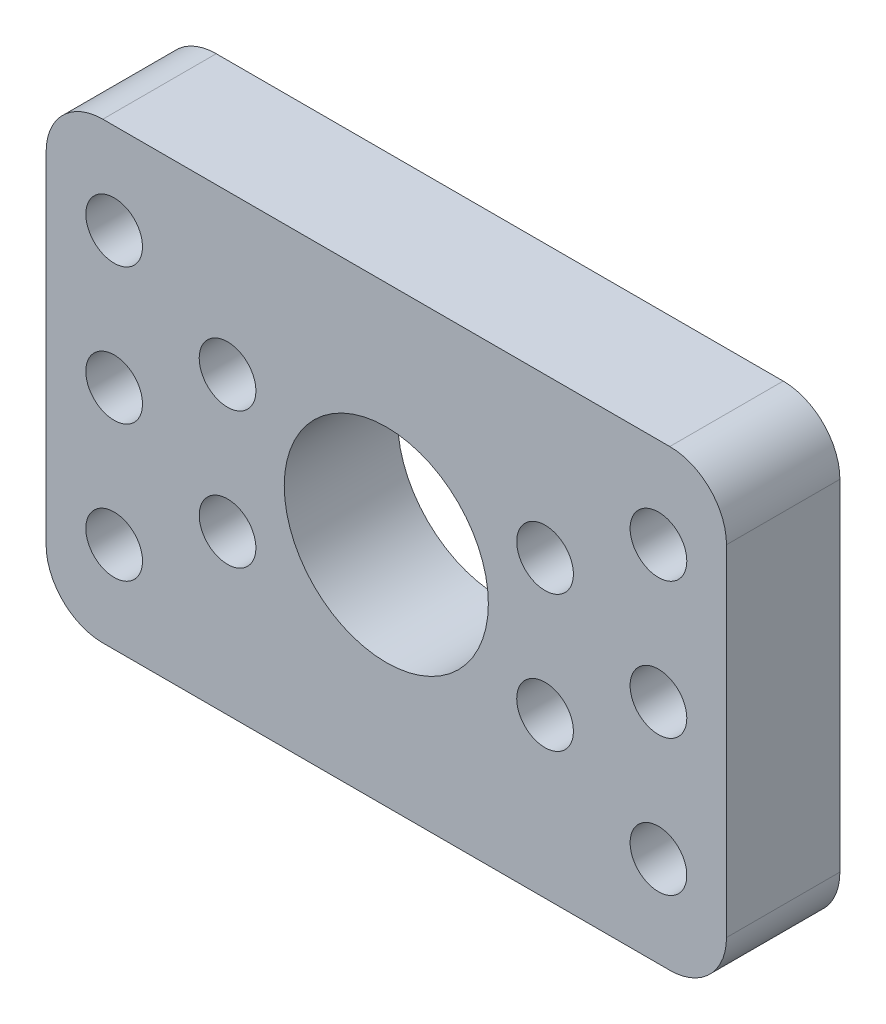
ISO-10303-21;
HEADER;
FILE_DESCRIPTION(('STEP AP214'),'2;1');
FILE_NAME('part.step','',(''),(''),'','','');
FILE_SCHEMA(('AUTOMOTIVE_DESIGN { 1 0 10303 214 1 1 1 1 }'));
ENDSEC;
DATA;
#1=APPLICATION_CONTEXT('core data for automotive mechanical design processes');
#2=APPLICATION_PROTOCOL_DEFINITION('international standard','automotive_design',2000,#1);
#3=PRODUCT_CONTEXT('',#1,'mechanical');
#4=PRODUCT('Part','Part','',(#3));
#5=PRODUCT_RELATED_PRODUCT_CATEGORY('part','',(#4));
#6=PRODUCT_DEFINITION_FORMATION('','',#4);
#7=PRODUCT_DEFINITION_CONTEXT('part definition',#1,'design');
#8=PRODUCT_DEFINITION('design','',#6,#7);
#9=PRODUCT_DEFINITION_SHAPE('','',#8);
#10=(LENGTH_UNIT() NAMED_UNIT(*) SI_UNIT(.MILLI.,.METRE.));
#11=(NAMED_UNIT(*) PLANE_ANGLE_UNIT() SI_UNIT($,.RADIAN.));
#12=(NAMED_UNIT(*) SI_UNIT($,.STERADIAN.) SOLID_ANGLE_UNIT());
#13=UNCERTAINTY_MEASURE_WITH_UNIT(LENGTH_MEASURE(1.E-05),#10,'distance_accuracy_value','');
#14=(GEOMETRIC_REPRESENTATION_CONTEXT(3) GLOBAL_UNCERTAINTY_ASSIGNED_CONTEXT((#13)) GLOBAL_UNIT_ASSIGNED_CONTEXT((#10,
#11,#12)) REPRESENTATION_CONTEXT('',''));
#15=CARTESIAN_POINT('',(0.,0.,0.));
#16=DIRECTION('',(0.,0.,1.));
#17=DIRECTION('',(1.,0.,0.));
#18=AXIS2_PLACEMENT_3D('',#15,#16,#17);
#19=CARTESIAN_POINT('',(25.,15.,10.));
#20=DIRECTION('',(0.,0.,-1.));
#21=DIRECTION('',(-1.,0.,0.));
#22=AXIS2_PLACEMENT_3D('',#19,#20,#21);
#23=PLANE('',#22);
#24=CARTESIAN_POINT('',(-14.,-6.,10.));
#25=DIRECTION('',(0.,0.,-1.));
#26=DIRECTION('',(1.,0.,0.));
#27=AXIS2_PLACEMENT_3D('',#24,#25,#26);
#28=CIRCLE('',#27,2.5);
#29=CARTESIAN_POINT('',(-11.5,-6.,10.));
#30=VERTEX_POINT('',#29);
#31=EDGE_CURVE('E221',#30,#30,#28,.T.);
#32=ORIENTED_EDGE('',*,*,#31,.T.);
#33=EDGE_LOOP('',(#32));
#34=FACE_BOUND('',#33,.T.);
#35=CARTESIAN_POINT('',(-24.,-12.,10.));
#36=DIRECTION('',(0.,0.,-1.));
#37=DIRECTION('',(1.,0.,0.));
#38=AXIS2_PLACEMENT_3D('',#35,#36,#37);
#39=CIRCLE('',#38,2.5);
#40=CARTESIAN_POINT('',(-21.5,-12.,10.));
#41=VERTEX_POINT('',#40);
#42=EDGE_CURVE('E227',#41,#41,#39,.T.);
#43=ORIENTED_EDGE('',*,*,#42,.T.);
#44=EDGE_LOOP('',(#43));
#45=FACE_BOUND('',#44,.T.);
#46=CARTESIAN_POINT('',(-24.,12.,10.));
#47=DIRECTION('',(0.,0.,-1.));
#48=DIRECTION('',(-1.,0.,0.));
#49=AXIS2_PLACEMENT_3D('',#46,#47,#48);
#50=CIRCLE('',#49,2.5);
#51=CARTESIAN_POINT('',(-26.5,12.,10.));
#52=VERTEX_POINT('',#51);
#53=EDGE_CURVE('E233',#52,#52,#50,.T.);
#54=ORIENTED_EDGE('',*,*,#53,.T.);
#55=EDGE_LOOP('',(#54));
#56=FACE_BOUND('',#55,.T.);
#57=CARTESIAN_POINT('',(-24.,0.,10.));
#58=DIRECTION('',(0.,0.,-1.));
#59=DIRECTION('',(-1.,0.,0.));
#60=AXIS2_PLACEMENT_3D('',#57,#58,#59);
#61=CIRCLE('',#60,2.5);
#62=CARTESIAN_POINT('',(-26.5,0.,10.));
#63=VERTEX_POINT('',#62);
#64=EDGE_CURVE('E239',#63,#63,#61,.T.);
#65=ORIENTED_EDGE('',*,*,#64,.T.);
#66=EDGE_LOOP('',(#65));
#67=FACE_BOUND('',#66,.T.);
#68=CARTESIAN_POINT('',(-14.,6.,10.));
#69=DIRECTION('',(0.,0.,-1.));
#70=DIRECTION('',(-1.,0.,0.));
#71=AXIS2_PLACEMENT_3D('',#68,#69,#70);
#72=CIRCLE('',#71,2.5);
#73=CARTESIAN_POINT('',(-16.5,6.,10.));
#74=VERTEX_POINT('',#73);
#75=EDGE_CURVE('E215',#74,#74,#72,.T.);
#76=ORIENTED_EDGE('',*,*,#75,.T.);
#77=EDGE_LOOP('',(#76));
#78=FACE_BOUND('',#77,.T.);
#79=CARTESIAN_POINT('',(14.,-6.,10.));
#80=DIRECTION('',(0.,0.,1.));
#81=DIRECTION('',(-1.,0.,0.));
#82=AXIS2_PLACEMENT_3D('',#79,#80,#81);
#83=CIRCLE('',#82,2.5);
#84=CARTESIAN_POINT('',(11.5,-6.,10.));
#85=VERTEX_POINT('',#84);
#86=EDGE_CURVE('E191',#85,#85,#83,.T.);
#87=ORIENTED_EDGE('',*,*,#86,.F.);
#88=EDGE_LOOP('',(#87));
#89=FACE_BOUND('',#88,.T.);
#90=CARTESIAN_POINT('',(24.,-12.,10.));
#91=DIRECTION('',(0.,0.,1.));
#92=DIRECTION('',(-1.,0.,0.));
#93=AXIS2_PLACEMENT_3D('',#90,#91,#92);
#94=CIRCLE('',#93,2.5);
#95=CARTESIAN_POINT('',(21.5,-12.,10.));
#96=VERTEX_POINT('',#95);
#97=EDGE_CURVE('E198',#96,#96,#94,.T.);
#98=ORIENTED_EDGE('',*,*,#97,.F.);
#99=EDGE_LOOP('',(#98));
#100=FACE_BOUND('',#99,.T.);
#101=CARTESIAN_POINT('',(24.,12.,10.));
#102=DIRECTION('',(0.,0.,1.));
#103=DIRECTION('',(1.,0.,0.));
#104=AXIS2_PLACEMENT_3D('',#101,#102,#103);
#105=CIRCLE('',#104,2.5);
#106=CARTESIAN_POINT('',(26.5,12.,10.));
#107=VERTEX_POINT('',#106);
#108=EDGE_CURVE('E204',#107,#107,#105,.T.);
#109=ORIENTED_EDGE('',*,*,#108,.F.);
#110=EDGE_LOOP('',(#109));
#111=FACE_BOUND('',#110,.T.);
#112=CARTESIAN_POINT('',(24.,0.,10.));
#113=DIRECTION('',(0.,0.,1.));
#114=DIRECTION('',(1.,0.,0.));
#115=AXIS2_PLACEMENT_3D('',#112,#113,#114);
#116=CIRCLE('',#115,2.5);
#117=CARTESIAN_POINT('',(26.5,0.,10.));
#118=VERTEX_POINT('',#117);
#119=EDGE_CURVE('E210',#118,#118,#116,.T.);
#120=ORIENTED_EDGE('',*,*,#119,.F.);
#121=EDGE_LOOP('',(#120));
#122=FACE_BOUND('',#121,.T.);
#123=CARTESIAN_POINT('',(14.,6.,10.));
#124=DIRECTION('',(0.,0.,1.));
#125=DIRECTION('',(1.,0.,0.));
#126=AXIS2_PLACEMENT_3D('',#123,#124,#125);
#127=CIRCLE('',#126,2.5);
#128=CARTESIAN_POINT('',(16.5,6.,10.));
#129=VERTEX_POINT('',#128);
#130=EDGE_CURVE('E185',#129,#129,#127,.T.);
#131=ORIENTED_EDGE('',*,*,#130,.F.);
#132=EDGE_LOOP('',(#131));
#133=FACE_BOUND('',#132,.T.);
#134=CARTESIAN_POINT('',(25.,15.,10.));
#135=DIRECTION('',(0.,0.,1.));
#136=DIRECTION('',(-1.,0.,0.));
#137=AXIS2_PLACEMENT_3D('',#134,#135,#136);
#138=CIRCLE('',#137,5.);
#139=CARTESIAN_POINT('',(30.,15.,10.));
#140=VERTEX_POINT('',#139);
#141=CARTESIAN_POINT('',(25.,20.,10.));
#142=VERTEX_POINT('',#141);
#143=EDGE_CURVE('E145',#140,#142,#138,.T.);
#144=ORIENTED_EDGE('',*,*,#143,.T.);
#145=DIRECTION('',(-1.,0.,0.));
#146=VECTOR('',#145,1.);
#147=CARTESIAN_POINT('',(-25.,20.,10.));
#148=LINE('',#147,#146);
#149=CARTESIAN_POINT('',(-25.,20.,10.));
#150=VERTEX_POINT('',#149);
#151=EDGE_CURVE('E93',#142,#150,#148,.T.);
#152=ORIENTED_EDGE('',*,*,#151,.T.);
#153=CARTESIAN_POINT('',(-25.,15.,10.));
#154=DIRECTION('',(0.,0.,1.));
#155=DIRECTION('',(1.,0.,0.));
#156=AXIS2_PLACEMENT_3D('',#153,#154,#155);
#157=CIRCLE('',#156,5.);
#158=CARTESIAN_POINT('',(-30.,15.,10.));
#159=VERTEX_POINT('',#158);
#160=EDGE_CURVE('E160',#150,#159,#157,.T.);
#161=ORIENTED_EDGE('',*,*,#160,.T.);
#162=DIRECTION('',(0.,-1.,0.));
#163=VECTOR('',#162,1.);
#164=CARTESIAN_POINT('',(-30.,15.,10.));
#165=LINE('',#164,#163);
#166=CARTESIAN_POINT('',(-30.,-15.,10.));
#167=VERTEX_POINT('',#166);
#168=EDGE_CURVE('E173',#159,#167,#165,.T.);
#169=ORIENTED_EDGE('',*,*,#168,.T.);
#170=CARTESIAN_POINT('',(-25.,-15.,10.));
#171=DIRECTION('',(0.,0.,1.));
#172=DIRECTION('',(1.,0.,0.));
#173=AXIS2_PLACEMENT_3D('',#170,#171,#172);
#174=CIRCLE('',#173,5.);
#175=CARTESIAN_POINT('',(-25.,-20.,10.));
#176=VERTEX_POINT('',#175);
#177=EDGE_CURVE('E112',#167,#176,#174,.T.);
#178=ORIENTED_EDGE('',*,*,#177,.T.);
#179=DIRECTION('',(1.,0.,0.));
#180=VECTOR('',#179,1.);
#181=CARTESIAN_POINT('',(-25.,-20.,10.));
#182=LINE('',#181,#180);
#183=CARTESIAN_POINT('',(25.,-20.,10.));
#184=VERTEX_POINT('',#183);
#185=EDGE_CURVE('E106',#176,#184,#182,.T.);
#186=ORIENTED_EDGE('',*,*,#185,.T.);
#187=CARTESIAN_POINT('',(25.,-15.,10.));
#188=DIRECTION('',(0.,0.,1.));
#189=DIRECTION('',(1.,0.,0.));
#190=AXIS2_PLACEMENT_3D('',#187,#188,#189);
#191=CIRCLE('',#190,5.);
#192=CARTESIAN_POINT('',(30.,-15.,10.));
#193=VERTEX_POINT('',#192);
#194=EDGE_CURVE('E110',#184,#193,#191,.T.);
#195=ORIENTED_EDGE('',*,*,#194,.T.);
#196=DIRECTION('',(0.,1.,0.));
#197=VECTOR('',#196,1.);
#198=CARTESIAN_POINT('',(30.,15.,10.));
#199=LINE('',#198,#197);
#200=EDGE_CURVE('E50',#193,#140,#199,.T.);
#201=ORIENTED_EDGE('',*,*,#200,.T.);
#202=EDGE_LOOP('',(#144,#152,#161,#169,#178,#186,#195,#201));
#203=FACE_BOUND('',#202,.T.);
#204=CARTESIAN_POINT('',(0.,0.,10.));
#205=DIRECTION('',(0.,0.,1.));
#206=DIRECTION('',(1.,0.,0.));
#207=AXIS2_PLACEMENT_3D('',#204,#205,#206);
#208=CIRCLE('',#207,9.);
#209=CARTESIAN_POINT('',(9.,0.,10.));
#210=VERTEX_POINT('',#209);
#211=EDGE_CURVE('E134',#210,#210,#208,.T.);
#212=ORIENTED_EDGE('',*,*,#211,.F.);
#213=EDGE_LOOP('',(#212));
#214=FACE_BOUND('',#213,.T.);
#215=ADVANCED_FACE('F33',(#34,#45,#56,#67,#78,#89,#100,#111,#122,#133,#203,#214),#23,.F.);
#216=CARTESIAN_POINT('',(25.,15.,0.));
#217=DIRECTION('',(0.,0.,-1.));
#218=DIRECTION('',(-1.,0.,0.));
#219=AXIS2_PLACEMENT_3D('',#216,#217,#218);
#220=PLANE('',#219);
#221=CARTESIAN_POINT('',(-14.,-6.,0.));
#222=DIRECTION('',(0.,0.,-1.));
#223=DIRECTION('',(1.,0.,0.));
#224=AXIS2_PLACEMENT_3D('',#221,#222,#223);
#225=CIRCLE('',#224,2.5);
#226=CARTESIAN_POINT('',(-11.5,-6.,0.));
#227=VERTEX_POINT('',#226);
#228=EDGE_CURVE('E224',#227,#227,#225,.T.);
#229=ORIENTED_EDGE('',*,*,#228,.F.);
#230=EDGE_LOOP('',(#229));
#231=FACE_BOUND('',#230,.T.);
#232=CARTESIAN_POINT('',(-24.,-12.,0.));
#233=DIRECTION('',(0.,0.,-1.));
#234=DIRECTION('',(1.,0.,0.));
#235=AXIS2_PLACEMENT_3D('',#232,#233,#234);
#236=CIRCLE('',#235,2.5);
#237=CARTESIAN_POINT('',(-21.5,-12.,0.));
#238=VERTEX_POINT('',#237);
#239=EDGE_CURVE('E230',#238,#238,#236,.T.);
#240=ORIENTED_EDGE('',*,*,#239,.F.);
#241=EDGE_LOOP('',(#240));
#242=FACE_BOUND('',#241,.T.);
#243=CARTESIAN_POINT('',(-24.,12.,0.));
#244=DIRECTION('',(0.,0.,-1.));
#245=DIRECTION('',(-1.,0.,0.));
#246=AXIS2_PLACEMENT_3D('',#243,#244,#245);
#247=CIRCLE('',#246,2.5);
#248=CARTESIAN_POINT('',(-26.5,12.,0.));
#249=VERTEX_POINT('',#248);
#250=EDGE_CURVE('E236',#249,#249,#247,.T.);
#251=ORIENTED_EDGE('',*,*,#250,.F.);
#252=EDGE_LOOP('',(#251));
#253=FACE_BOUND('',#252,.T.);
#254=CARTESIAN_POINT('',(-24.,0.,0.));
#255=DIRECTION('',(0.,0.,-1.));
#256=DIRECTION('',(-1.,0.,0.));
#257=AXIS2_PLACEMENT_3D('',#254,#255,#256);
#258=CIRCLE('',#257,2.5);
#259=CARTESIAN_POINT('',(-26.5,0.,0.));
#260=VERTEX_POINT('',#259);
#261=EDGE_CURVE('E218',#260,#260,#258,.T.);
#262=ORIENTED_EDGE('',*,*,#261,.F.);
#263=EDGE_LOOP('',(#262));
#264=FACE_BOUND('',#263,.T.);
#265=CARTESIAN_POINT('',(-14.,6.,0.));
#266=DIRECTION('',(0.,0.,-1.));
#267=DIRECTION('',(-1.,0.,0.));
#268=AXIS2_PLACEMENT_3D('',#265,#266,#267);
#269=CIRCLE('',#268,2.5);
#270=CARTESIAN_POINT('',(-16.5,6.,0.));
#271=VERTEX_POINT('',#270);
#272=EDGE_CURVE('E195',#271,#271,#269,.T.);
#273=ORIENTED_EDGE('',*,*,#272,.F.);
#274=EDGE_LOOP('',(#273));
#275=FACE_BOUND('',#274,.T.);
#276=CARTESIAN_POINT('',(14.,-6.,0.));
#277=DIRECTION('',(0.,0.,1.));
#278=DIRECTION('',(-1.,0.,0.));
#279=AXIS2_PLACEMENT_3D('',#276,#277,#278);
#280=CIRCLE('',#279,2.5);
#281=CARTESIAN_POINT('',(11.5,-6.,0.));
#282=VERTEX_POINT('',#281);
#283=EDGE_CURVE('E194',#282,#282,#280,.T.);
#284=ORIENTED_EDGE('',*,*,#283,.T.);
#285=EDGE_LOOP('',(#284));
#286=FACE_BOUND('',#285,.T.);
#287=CARTESIAN_POINT('',(24.,-12.,0.));
#288=DIRECTION('',(0.,0.,1.));
#289=DIRECTION('',(-1.,0.,0.));
#290=AXIS2_PLACEMENT_3D('',#287,#288,#289);
#291=CIRCLE('',#290,2.5);
#292=CARTESIAN_POINT('',(21.5,-12.,0.));
#293=VERTEX_POINT('',#292);
#294=EDGE_CURVE('E201',#293,#293,#291,.T.);
#295=ORIENTED_EDGE('',*,*,#294,.T.);
#296=EDGE_LOOP('',(#295));
#297=FACE_BOUND('',#296,.T.);
#298=CARTESIAN_POINT('',(24.,12.,0.));
#299=DIRECTION('',(0.,0.,1.));
#300=DIRECTION('',(1.,0.,0.));
#301=AXIS2_PLACEMENT_3D('',#298,#299,#300);
#302=CIRCLE('',#301,2.5);
#303=CARTESIAN_POINT('',(26.5,12.,0.));
#304=VERTEX_POINT('',#303);
#305=EDGE_CURVE('E207',#304,#304,#302,.T.);
#306=ORIENTED_EDGE('',*,*,#305,.T.);
#307=EDGE_LOOP('',(#306));
#308=FACE_BOUND('',#307,.T.);
#309=CARTESIAN_POINT('',(24.,0.,0.));
#310=DIRECTION('',(0.,0.,1.));
#311=DIRECTION('',(1.,0.,0.));
#312=AXIS2_PLACEMENT_3D('',#309,#310,#311);
#313=CIRCLE('',#312,2.5);
#314=CARTESIAN_POINT('',(26.5,0.,0.));
#315=VERTEX_POINT('',#314);
#316=EDGE_CURVE('E188',#315,#315,#313,.T.);
#317=ORIENTED_EDGE('',*,*,#316,.T.);
#318=EDGE_LOOP('',(#317));
#319=FACE_BOUND('',#318,.T.);
#320=CARTESIAN_POINT('',(14.,6.,0.));
#321=DIRECTION('',(0.,0.,1.));
#322=DIRECTION('',(1.,0.,0.));
#323=AXIS2_PLACEMENT_3D('',#320,#321,#322);
#324=CIRCLE('',#323,2.5);
#325=CARTESIAN_POINT('',(16.5,6.,0.));
#326=VERTEX_POINT('',#325);
#327=EDGE_CURVE('E182',#326,#326,#324,.T.);
#328=ORIENTED_EDGE('',*,*,#327,.T.);
#329=EDGE_LOOP('',(#328));
#330=FACE_BOUND('',#329,.T.);
#331=CARTESIAN_POINT('',(25.,15.,0.));
#332=DIRECTION('',(0.,0.,1.));
#333=DIRECTION('',(-1.,0.,0.));
#334=AXIS2_PLACEMENT_3D('',#331,#332,#333);
#335=CIRCLE('',#334,5.);
#336=CARTESIAN_POINT('',(30.,15.,0.));
#337=VERTEX_POINT('',#336);
#338=CARTESIAN_POINT('',(25.,20.,0.));
#339=VERTEX_POINT('',#338);
#340=EDGE_CURVE('E130',#337,#339,#335,.T.);
#341=ORIENTED_EDGE('',*,*,#340,.F.);
#342=DIRECTION('',(0.,1.,0.));
#343=VECTOR('',#342,1.);
#344=CARTESIAN_POINT('',(30.,15.,0.));
#345=LINE('',#344,#343);
#346=CARTESIAN_POINT('',(30.,-15.,0.));
#347=VERTEX_POINT('',#346);
#348=EDGE_CURVE('E85',#347,#337,#345,.T.);
#349=ORIENTED_EDGE('',*,*,#348,.F.);
#350=CARTESIAN_POINT('',(25.,-15.,0.));
#351=DIRECTION('',(0.,0.,1.));
#352=DIRECTION('',(1.,0.,0.));
#353=AXIS2_PLACEMENT_3D('',#350,#351,#352);
#354=CIRCLE('',#353,5.);
#355=CARTESIAN_POINT('',(25.,-20.,0.));
#356=VERTEX_POINT('',#355);
#357=EDGE_CURVE('E79',#356,#347,#354,.T.);
#358=ORIENTED_EDGE('',*,*,#357,.F.);
#359=DIRECTION('',(1.,0.,0.));
#360=VECTOR('',#359,1.);
#361=CARTESIAN_POINT('',(-25.,-20.,0.));
#362=LINE('',#361,#360);
#363=CARTESIAN_POINT('',(-25.,-20.,0.));
#364=VERTEX_POINT('',#363);
#365=EDGE_CURVE('E120',#364,#356,#362,.T.);
#366=ORIENTED_EDGE('',*,*,#365,.F.);
#367=CARTESIAN_POINT('',(-25.,-15.,0.));
#368=DIRECTION('',(0.,0.,1.));
#369=DIRECTION('',(1.,0.,0.));
#370=AXIS2_PLACEMENT_3D('',#367,#368,#369);
#371=CIRCLE('',#370,5.);
#372=CARTESIAN_POINT('',(-30.,-15.,0.));
#373=VERTEX_POINT('',#372);
#374=EDGE_CURVE('E140',#373,#364,#371,.T.);
#375=ORIENTED_EDGE('',*,*,#374,.F.);
#376=DIRECTION('',(0.,-1.,0.));
#377=VECTOR('',#376,1.);
#378=CARTESIAN_POINT('',(-30.,15.,0.));
#379=LINE('',#378,#377);
#380=CARTESIAN_POINT('',(-30.,15.,0.));
#381=VERTEX_POINT('',#380);
#382=EDGE_CURVE('E138',#381,#373,#379,.T.);
#383=ORIENTED_EDGE('',*,*,#382,.F.);
#384=CARTESIAN_POINT('',(-25.,15.,0.));
#385=DIRECTION('',(0.,0.,1.));
#386=DIRECTION('',(1.,0.,0.));
#387=AXIS2_PLACEMENT_3D('',#384,#385,#386);
#388=CIRCLE('',#387,5.);
#389=CARTESIAN_POINT('',(-25.,20.,0.));
#390=VERTEX_POINT('',#389);
#391=EDGE_CURVE('E136',#390,#381,#388,.T.);
#392=ORIENTED_EDGE('',*,*,#391,.F.);
#393=DIRECTION('',(-1.,0.,0.));
#394=VECTOR('',#393,1.);
#395=CARTESIAN_POINT('',(-25.,20.,0.));
#396=LINE('',#395,#394);
#397=EDGE_CURVE('E133',#339,#390,#396,.T.);
#398=ORIENTED_EDGE('',*,*,#397,.F.);
#399=EDGE_LOOP('',(#341,#349,#358,#366,#375,#383,#392,#398));
#400=FACE_BOUND('',#399,.T.);
#401=CARTESIAN_POINT('',(0.,0.,0.));
#402=DIRECTION('',(0.,0.,1.));
#403=DIRECTION('',(1.,0.,0.));
#404=AXIS2_PLACEMENT_3D('',#401,#402,#403);
#405=CIRCLE('',#404,9.);
#406=CARTESIAN_POINT('',(9.,0.,0.));
#407=VERTEX_POINT('',#406);
#408=EDGE_CURVE('E179',#407,#407,#405,.T.);
#409=ORIENTED_EDGE('',*,*,#408,.T.);
#410=EDGE_LOOP('',(#409));
#411=FACE_BOUND('',#410,.T.);
#412=ADVANCED_FACE('F164',(#231,#242,#253,#264,#275,#286,#297,#308,#319,#330,#400,#411),#220,.T.);
#413=CARTESIAN_POINT('',(25.,15.,10.));
#414=DIRECTION('',(0.,0.,-1.));
#415=DIRECTION('',(-1.,0.,0.));
#416=AXIS2_PLACEMENT_3D('',#413,#414,#415);
#417=CYLINDRICAL_SURFACE('',#416,5.);
#418=ORIENTED_EDGE('',*,*,#340,.T.);
#419=DIRECTION('',(0.,0.,-1.));
#420=VECTOR('',#419,1.);
#421=CARTESIAN_POINT('',(25.,20.,10.));
#422=LINE('',#421,#420);
#423=EDGE_CURVE('E11',#142,#339,#422,.T.);
#424=ORIENTED_EDGE('',*,*,#423,.F.);
#425=ORIENTED_EDGE('',*,*,#143,.F.);
#426=DIRECTION('',(0.,0.,-1.));
#427=VECTOR('',#426,1.);
#428=CARTESIAN_POINT('',(30.,15.,10.));
#429=LINE('',#428,#427);
#430=EDGE_CURVE('E126',#140,#337,#429,.T.);
#431=ORIENTED_EDGE('',*,*,#430,.T.);
#432=EDGE_LOOP('',(#418,#424,#425,#431));
#433=FACE_BOUND('',#432,.T.);
#434=ADVANCED_FACE('F35',(#433),#417,.T.);
#435=CARTESIAN_POINT('',(-25.,20.,10.));
#436=DIRECTION('',(0.,-1.,0.));
#437=DIRECTION('',(0.,0.,-1.));
#438=AXIS2_PLACEMENT_3D('',#435,#436,#437);
#439=PLANE('',#438);
#440=ORIENTED_EDGE('',*,*,#397,.T.);
#441=DIRECTION('',(0.,0.,-1.));
#442=VECTOR('',#441,1.);
#443=CARTESIAN_POINT('',(-25.,20.,10.));
#444=LINE('',#443,#442);
#445=EDGE_CURVE('E42',#150,#390,#444,.T.);
#446=ORIENTED_EDGE('',*,*,#445,.F.);
#447=ORIENTED_EDGE('',*,*,#151,.F.);
#448=ORIENTED_EDGE('',*,*,#423,.T.);
#449=EDGE_LOOP('',(#440,#446,#447,#448));
#450=FACE_BOUND('',#449,.T.);
#451=ADVANCED_FACE('F292',(#450),#439,.F.);
#452=CARTESIAN_POINT('',(-25.,15.,10.));
#453=DIRECTION('',(0.,0.,-1.));
#454=DIRECTION('',(-1.,0.,0.));
#455=AXIS2_PLACEMENT_3D('',#452,#453,#454);
#456=CYLINDRICAL_SURFACE('',#455,5.);
#457=ORIENTED_EDGE('',*,*,#391,.T.);
#458=DIRECTION('',(0.,0.,-1.));
#459=VECTOR('',#458,1.);
#460=CARTESIAN_POINT('',(-30.,15.,10.));
#461=LINE('',#460,#459);
#462=EDGE_CURVE('E152',#159,#381,#461,.T.);
#463=ORIENTED_EDGE('',*,*,#462,.F.);
#464=ORIENTED_EDGE('',*,*,#160,.F.);
#465=ORIENTED_EDGE('',*,*,#445,.T.);
#466=EDGE_LOOP('',(#457,#463,#464,#465));
#467=FACE_BOUND('',#466,.T.);
#468=ADVANCED_FACE('F158',(#467),#456,.T.);
#469=CARTESIAN_POINT('',(-30.,15.,10.));
#470=DIRECTION('',(1.,0.,0.));
#471=DIRECTION('',(0.,1.,0.));
#472=AXIS2_PLACEMENT_3D('',#469,#470,#471);
#473=PLANE('',#472);
#474=ORIENTED_EDGE('',*,*,#382,.T.);
#475=DIRECTION('',(0.,0.,-1.));
#476=VECTOR('',#475,1.);
#477=CARTESIAN_POINT('',(-30.,-15.,10.));
#478=LINE('',#477,#476);
#479=EDGE_CURVE('E149',#167,#373,#478,.T.);
#480=ORIENTED_EDGE('',*,*,#479,.F.);
#481=ORIENTED_EDGE('',*,*,#168,.F.);
#482=ORIENTED_EDGE('',*,*,#462,.T.);
#483=EDGE_LOOP('',(#474,#480,#481,#482));
#484=FACE_BOUND('',#483,.T.);
#485=ADVANCED_FACE('F169',(#484),#473,.F.);
#486=CARTESIAN_POINT('',(-25.,-15.,10.));
#487=DIRECTION('',(0.,0.,-1.));
#488=DIRECTION('',(-1.,0.,0.));
#489=AXIS2_PLACEMENT_3D('',#486,#487,#488);
#490=CYLINDRICAL_SURFACE('',#489,5.);
#491=ORIENTED_EDGE('',*,*,#374,.T.);
#492=DIRECTION('',(0.,0.,-1.));
#493=VECTOR('',#492,1.);
#494=CARTESIAN_POINT('',(-25.,-20.,10.));
#495=LINE('',#494,#493);
#496=EDGE_CURVE('E121',#176,#364,#495,.T.);
#497=ORIENTED_EDGE('',*,*,#496,.F.);
#498=ORIENTED_EDGE('',*,*,#177,.F.);
#499=ORIENTED_EDGE('',*,*,#479,.T.);
#500=EDGE_LOOP('',(#491,#497,#498,#499));
#501=FACE_BOUND('',#500,.T.);
#502=ADVANCED_FACE('F172',(#501),#490,.T.);
#503=CARTESIAN_POINT('',(-25.,-20.,10.));
#504=DIRECTION('',(0.,1.,0.));
#505=DIRECTION('',(0.,0.,1.));
#506=AXIS2_PLACEMENT_3D('',#503,#504,#505);
#507=PLANE('',#506);
#508=ORIENTED_EDGE('',*,*,#365,.T.);
#509=DIRECTION('',(0.,0.,-1.));
#510=VECTOR('',#509,1.);
#511=CARTESIAN_POINT('',(25.,-20.,10.));
#512=LINE('',#511,#510);
#513=EDGE_CURVE('E117',#184,#356,#512,.T.);
#514=ORIENTED_EDGE('',*,*,#513,.F.);
#515=ORIENTED_EDGE('',*,*,#185,.F.);
#516=ORIENTED_EDGE('',*,*,#496,.T.);
#517=EDGE_LOOP('',(#508,#514,#515,#516));
#518=FACE_BOUND('',#517,.T.);
#519=ADVANCED_FACE('F118',(#518),#507,.F.);
#520=CARTESIAN_POINT('',(25.,-15.,10.));
#521=DIRECTION('',(0.,0.,-1.));
#522=DIRECTION('',(-1.,0.,0.));
#523=AXIS2_PLACEMENT_3D('',#520,#521,#522);
#524=CYLINDRICAL_SURFACE('',#523,5.);
#525=ORIENTED_EDGE('',*,*,#357,.T.);
#526=DIRECTION('',(0.,0.,-1.));
#527=VECTOR('',#526,1.);
#528=CARTESIAN_POINT('',(30.,-15.,10.));
#529=LINE('',#528,#527);
#530=EDGE_CURVE('E122',#193,#347,#529,.T.);
#531=ORIENTED_EDGE('',*,*,#530,.F.);
#532=ORIENTED_EDGE('',*,*,#194,.F.);
#533=ORIENTED_EDGE('',*,*,#513,.T.);
#534=EDGE_LOOP('',(#525,#531,#532,#533));
#535=FACE_BOUND('',#534,.T.);
#536=ADVANCED_FACE('F124',(#535),#524,.T.);
#537=CARTESIAN_POINT('',(30.,15.,10.));
#538=DIRECTION('',(-1.,0.,0.));
#539=DIRECTION('',(0.,-1.,0.));
#540=AXIS2_PLACEMENT_3D('',#537,#538,#539);
#541=PLANE('',#540);
#542=ORIENTED_EDGE('',*,*,#348,.T.);
#543=ORIENTED_EDGE('',*,*,#430,.F.);
#544=ORIENTED_EDGE('',*,*,#200,.F.);
#545=ORIENTED_EDGE('',*,*,#530,.T.);
#546=EDGE_LOOP('',(#542,#543,#544,#545));
#547=FACE_BOUND('',#546,.T.);
#548=ADVANCED_FACE('F280',(#547),#541,.F.);
#549=CARTESIAN_POINT('',(0.,0.,10.));
#550=DIRECTION('',(0.,0.,-1.));
#551=DIRECTION('',(-1.,0.,0.));
#552=AXIS2_PLACEMENT_3D('',#549,#550,#551);
#553=CYLINDRICAL_SURFACE('',#552,9.);
#554=ORIENTED_EDGE('',*,*,#211,.T.);
#555=EDGE_LOOP('',(#554));
#556=FACE_BOUND('',#555,.T.);
#557=ORIENTED_EDGE('',*,*,#408,.F.);
#558=EDGE_LOOP('',(#557));
#559=FACE_BOUND('',#558,.T.);
#560=ADVANCED_FACE('F268',(#556,#559),#553,.F.);
#561=CARTESIAN_POINT('',(14.,6.,0.));
#562=DIRECTION('',(0.,0.,1.));
#563=DIRECTION('',(1.,0.,0.));
#564=AXIS2_PLACEMENT_3D('',#561,#562,#563);
#565=CYLINDRICAL_SURFACE('',#564,2.5);
#566=ORIENTED_EDGE('',*,*,#327,.F.);
#567=EDGE_LOOP('',(#566));
#568=FACE_BOUND('',#567,.T.);
#569=ORIENTED_EDGE('',*,*,#130,.T.);
#570=EDGE_LOOP('',(#569));
#571=FACE_BOUND('',#570,.T.);
#572=ADVANCED_FACE('F264',(#568,#571),#565,.F.);
#573=CARTESIAN_POINT('',(24.,0.,0.));
#574=DIRECTION('',(0.,0.,1.));
#575=DIRECTION('',(1.,0.,0.));
#576=AXIS2_PLACEMENT_3D('',#573,#574,#575);
#577=CYLINDRICAL_SURFACE('',#576,2.5);
#578=ORIENTED_EDGE('',*,*,#316,.F.);
#579=EDGE_LOOP('',(#578));
#580=FACE_BOUND('',#579,.T.);
#581=ORIENTED_EDGE('',*,*,#119,.T.);
#582=EDGE_LOOP('',(#581));
#583=FACE_BOUND('',#582,.T.);
#584=ADVANCED_FACE('F267',(#580,#583),#577,.F.);
#585=CARTESIAN_POINT('',(24.,12.,0.));
#586=DIRECTION('',(0.,0.,1.));
#587=DIRECTION('',(1.,0.,0.));
#588=AXIS2_PLACEMENT_3D('',#585,#586,#587);
#589=CYLINDRICAL_SURFACE('',#588,2.5);
#590=ORIENTED_EDGE('',*,*,#305,.F.);
#591=EDGE_LOOP('',(#590));
#592=FACE_BOUND('',#591,.T.);
#593=ORIENTED_EDGE('',*,*,#108,.T.);
#594=EDGE_LOOP('',(#593));
#595=FACE_BOUND('',#594,.T.);
#596=ADVANCED_FACE('F368',(#592,#595),#589,.F.);
#597=CARTESIAN_POINT('',(24.,-12.,0.));
#598=DIRECTION('',(0.,0.,1.));
#599=DIRECTION('',(1.,0.,0.));
#600=AXIS2_PLACEMENT_3D('',#597,#598,#599);
#601=CYLINDRICAL_SURFACE('',#600,2.5);
#602=ORIENTED_EDGE('',*,*,#294,.F.);
#603=EDGE_LOOP('',(#602));
#604=FACE_BOUND('',#603,.T.);
#605=ORIENTED_EDGE('',*,*,#97,.T.);
#606=EDGE_LOOP('',(#605));
#607=FACE_BOUND('',#606,.T.);
#608=ADVANCED_FACE('F372',(#604,#607),#601,.F.);
#609=CARTESIAN_POINT('',(14.,-6.,0.));
#610=DIRECTION('',(0.,0.,1.));
#611=DIRECTION('',(1.,0.,0.));
#612=AXIS2_PLACEMENT_3D('',#609,#610,#611);
#613=CYLINDRICAL_SURFACE('',#612,2.5);
#614=ORIENTED_EDGE('',*,*,#283,.F.);
#615=EDGE_LOOP('',(#614));
#616=FACE_BOUND('',#615,.T.);
#617=ORIENTED_EDGE('',*,*,#86,.T.);
#618=EDGE_LOOP('',(#617));
#619=FACE_BOUND('',#618,.T.);
#620=ADVANCED_FACE('F319',(#616,#619),#613,.F.);
#621=CARTESIAN_POINT('',(-14.,6.,0.));
#622=DIRECTION('',(0.,0.,1.));
#623=DIRECTION('',(1.,0.,0.));
#624=AXIS2_PLACEMENT_3D('',#621,#622,#623);
#625=CYLINDRICAL_SURFACE('',#624,2.5);
#626=ORIENTED_EDGE('',*,*,#272,.T.);
#627=EDGE_LOOP('',(#626));
#628=FACE_BOUND('',#627,.T.);
#629=ORIENTED_EDGE('',*,*,#75,.F.);
#630=EDGE_LOOP('',(#629));
#631=FACE_BOUND('',#630,.T.);
#632=ADVANCED_FACE('F314',(#628,#631),#625,.F.);
#633=CARTESIAN_POINT('',(-24.,0.,0.));
#634=DIRECTION('',(0.,0.,1.));
#635=DIRECTION('',(1.,0.,0.));
#636=AXIS2_PLACEMENT_3D('',#633,#634,#635);
#637=CYLINDRICAL_SURFACE('',#636,2.5);
#638=ORIENTED_EDGE('',*,*,#261,.T.);
#639=EDGE_LOOP('',(#638));
#640=FACE_BOUND('',#639,.T.);
#641=ORIENTED_EDGE('',*,*,#64,.F.);
#642=EDGE_LOOP('',(#641));
#643=FACE_BOUND('',#642,.T.);
#644=ADVANCED_FACE('F245',(#640,#643),#637,.F.);
#645=CARTESIAN_POINT('',(-24.,12.,0.));
#646=DIRECTION('',(0.,0.,1.));
#647=DIRECTION('',(1.,0.,0.));
#648=AXIS2_PLACEMENT_3D('',#645,#646,#647);
#649=CYLINDRICAL_SURFACE('',#648,2.5);
#650=ORIENTED_EDGE('',*,*,#250,.T.);
#651=EDGE_LOOP('',(#650));
#652=FACE_BOUND('',#651,.T.);
#653=ORIENTED_EDGE('',*,*,#53,.F.);
#654=EDGE_LOOP('',(#653));
#655=FACE_BOUND('',#654,.T.);
#656=ADVANCED_FACE('F331',(#652,#655),#649,.F.);
#657=CARTESIAN_POINT('',(-24.,-12.,0.));
#658=DIRECTION('',(0.,0.,1.));
#659=DIRECTION('',(1.,0.,0.));
#660=AXIS2_PLACEMENT_3D('',#657,#658,#659);
#661=CYLINDRICAL_SURFACE('',#660,2.5);
#662=ORIENTED_EDGE('',*,*,#239,.T.);
#663=EDGE_LOOP('',(#662));
#664=FACE_BOUND('',#663,.T.);
#665=ORIENTED_EDGE('',*,*,#42,.F.);
#666=EDGE_LOOP('',(#665));
#667=FACE_BOUND('',#666,.T.);
#668=ADVANCED_FACE('F340',(#664,#667),#661,.F.);
#669=CARTESIAN_POINT('',(-14.,-6.,0.));
#670=DIRECTION('',(0.,0.,1.));
#671=DIRECTION('',(1.,0.,0.));
#672=AXIS2_PLACEMENT_3D('',#669,#670,#671);
#673=CYLINDRICAL_SURFACE('',#672,2.5);
#674=ORIENTED_EDGE('',*,*,#228,.T.);
#675=EDGE_LOOP('',(#674));
#676=FACE_BOUND('',#675,.T.);
#677=ORIENTED_EDGE('',*,*,#31,.F.);
#678=EDGE_LOOP('',(#677));
#679=FACE_BOUND('',#678,.T.);
#680=ADVANCED_FACE('F350',(#676,#679),#673,.F.);
#681=CLOSED_SHELL('',(#215,#412,#434,#451,#468,#485,#502,#519,#536,#548,#560,#572,#584,#596,
#608,#620,#632,#644,#656,#668,#680));
#682=MANIFOLD_SOLID_BREP('B2',#681);
#683=ADVANCED_BREP_SHAPE_REPRESENTATION('',(#18,#682),#14);
#684=SHAPE_DEFINITION_REPRESENTATION(#9,#683);
ENDSEC;
END-ISO-10303-21;
